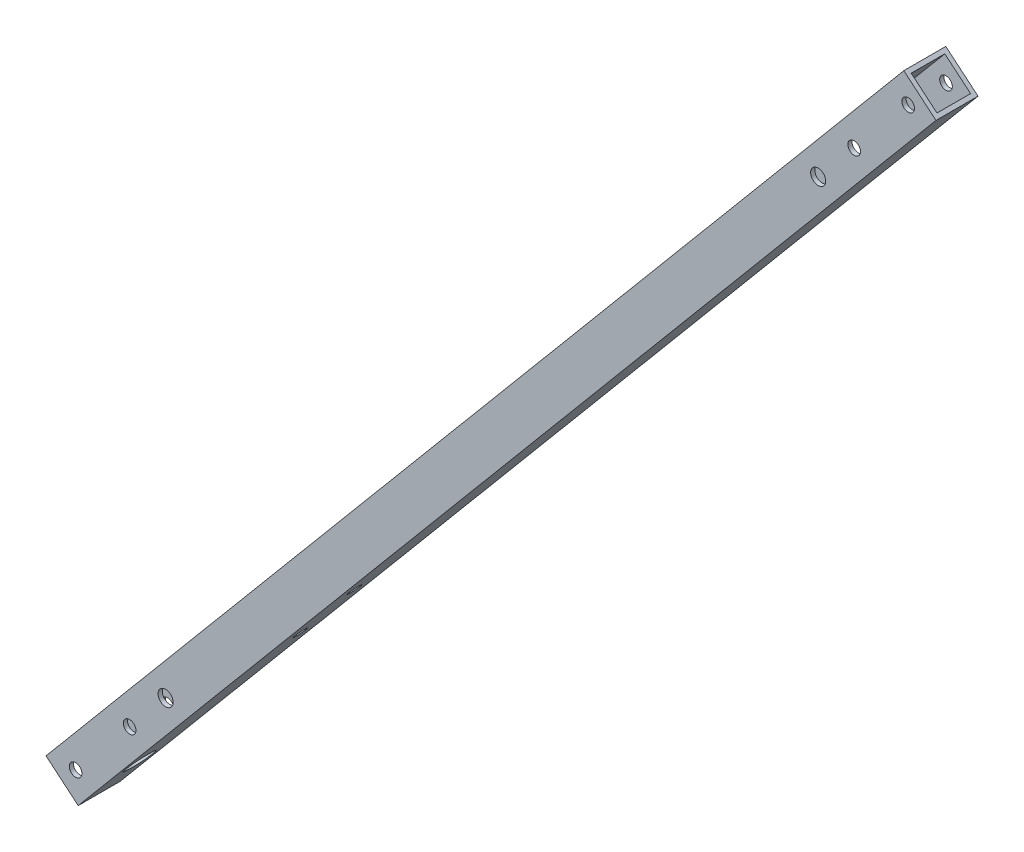
ISO-10303-21;
HEADER;
FILE_DESCRIPTION(('STEP AP214'),'2;1');
FILE_NAME('part.step','',(''),(''),'','','');
FILE_SCHEMA(('AUTOMOTIVE_DESIGN { 1 0 10303 214 1 1 1 1 }'));
ENDSEC;
DATA;
#1=APPLICATION_CONTEXT('core data for automotive mechanical design processes');
#2=APPLICATION_PROTOCOL_DEFINITION('international standard','automotive_design',2000,#1);
#3=PRODUCT_CONTEXT('',#1,'mechanical');
#4=PRODUCT('Part','Part','',(#3));
#5=PRODUCT_RELATED_PRODUCT_CATEGORY('part','',(#4));
#6=PRODUCT_DEFINITION_FORMATION('','',#4);
#7=PRODUCT_DEFINITION_CONTEXT('part definition',#1,'design');
#8=PRODUCT_DEFINITION('design','',#6,#7);
#9=PRODUCT_DEFINITION_SHAPE('','',#8);
#10=(LENGTH_UNIT() NAMED_UNIT(*) SI_UNIT(.MILLI.,.METRE.));
#11=(NAMED_UNIT(*) PLANE_ANGLE_UNIT() SI_UNIT($,.RADIAN.));
#12=(NAMED_UNIT(*) SI_UNIT($,.STERADIAN.) SOLID_ANGLE_UNIT());
#13=UNCERTAINTY_MEASURE_WITH_UNIT(LENGTH_MEASURE(1.E-05),#10,'distance_accuracy_value','');
#14=(GEOMETRIC_REPRESENTATION_CONTEXT(3) GLOBAL_UNCERTAINTY_ASSIGNED_CONTEXT((#13)) GLOBAL_UNIT_ASSIGNED_CONTEXT((#10,
#11,#12)) REPRESENTATION_CONTEXT('',''));
#15=CARTESIAN_POINT('',(0.,0.,0.));
#16=DIRECTION('',(0.,0.,1.));
#17=DIRECTION('',(1.,0.,0.));
#18=AXIS2_PLACEMENT_3D('',#15,#16,#17);
#19=CARTESIAN_POINT('',(0.,0.,-13.5));
#20=DIRECTION('',(0.,0.,1.));
#21=DIRECTION('',(-1.,0.,0.));
#22=AXIS2_PLACEMENT_3D('',#19,#20,#21);
#23=PLANE('',#22);
#24=CARTESIAN_POINT('',(31.2149542335838,48.8684625519902,-13.5));
#25=DIRECTION('',(0.,0.,1.));
#26=DIRECTION('',(1.,0.,0.));
#27=AXIS2_PLACEMENT_3D('',#24,#25,#26);
#28=CIRCLE('',#27,4.99999999999999);
#29=CARTESIAN_POINT('',(36.2149542335838,48.8684625519902,-13.5));
#30=VERTEX_POINT('',#29);
#31=EDGE_CURVE('E420',#30,#30,#28,.T.);
#32=ORIENTED_EDGE('',*,*,#31,.F.);
#33=EDGE_LOOP('',(#32));
#34=FACE_BOUND('',#33,.T.);
#35=CARTESIAN_POINT('',(277.034916912995,341.825286206554,-13.5));
#36=DIRECTION('',(0.,0.,-1.));
#37=DIRECTION('',(-1.,0.,0.));
#38=AXIS2_PLACEMENT_3D('',#35,#36,#37);
#39=CIRCLE('',#38,2.24999999999996);
#40=CARTESIAN_POINT('',(274.784916912995,341.825286206554,-13.5));
#41=VERTEX_POINT('',#40);
#42=EDGE_CURVE('E213',#41,#41,#39,.T.);
#43=ORIENTED_EDGE('',*,*,#42,.T.);
#44=EDGE_LOOP('',(#43));
#45=FACE_BOUND('',#44,.T.);
#46=CARTESIAN_POINT('',(18.3592020398528,33.5475736896108,-13.5));
#47=DIRECTION('',(0.,0.,-1.));
#48=DIRECTION('',(-1.,0.,0.));
#49=AXIS2_PLACEMENT_3D('',#46,#47,#48);
#50=CIRCLE('',#49,2.25);
#51=CARTESIAN_POINT('',(16.1092020398528,33.5475736896108,-13.5));
#52=VERTEX_POINT('',#51);
#53=EDGE_CURVE('E222',#52,#52,#50,.T.);
#54=ORIENTED_EDGE('',*,*,#53,.T.);
#55=EDGE_LOOP('',(#54));
#56=FACE_BOUND('',#55,.T.);
#57=CARTESIAN_POINT('',(-0.924426250743316,10.5662403960414,-13.5));
#58=DIRECTION('',(0.,0.,-1.));
#59=DIRECTION('',(-1.,0.,0.));
#60=AXIS2_PLACEMENT_3D('',#57,#58,#59);
#61=CIRCLE('',#60,2.25);
#62=CARTESIAN_POINT('',(-3.17442625074332,10.5662403960414,-13.5));
#63=VERTEX_POINT('',#62);
#64=EDGE_CURVE('E231',#63,#63,#61,.T.);
#65=ORIENTED_EDGE('',*,*,#64,.T.);
#66=EDGE_LOOP('',(#65));
#67=FACE_BOUND('',#66,.T.);
#68=CARTESIAN_POINT('',(296.318545203591,364.806619500123,-13.5));
#69=DIRECTION('',(0.,0.,-1.));
#70=DIRECTION('',(-1.,0.,0.));
#71=AXIS2_PLACEMENT_3D('',#68,#69,#70);
#72=CIRCLE('',#71,2.24999999999996);
#73=CARTESIAN_POINT('',(294.068545203591,364.806619500123,-13.5));
#74=VERTEX_POINT('',#73);
#75=EDGE_CURVE('E245',#74,#74,#72,.T.);
#76=ORIENTED_EDGE('',*,*,#75,.T.);
#77=EDGE_LOOP('',(#76));
#78=FACE_BOUND('',#77,.T.);
#79=DIRECTION('',(0.766044443118979,-0.642787609686539,0.));
#80=VECTOR('',#79,1.);
#81=CARTESIAN_POINT('',(295.900398007839,373.642634038516,-13.5));
#82=LINE('',#81,#80);
#83=CARTESIAN_POINT('',(295.900398007839,373.642634038516,-13.5));
#84=VERTEX_POINT('',#83);
#85=CARTESIAN_POINT('',(305.092931325267,365.929182722278,-13.5));
#86=VERTEX_POINT('',#85);
#87=EDGE_CURVE('E134',#84,#86,#82,.T.);
#88=ORIENTED_EDGE('',*,*,#87,.F.);
#89=DIRECTION('',(-0.642787609686538,-0.766044443118979,0.));
#90=VECTOR('',#89,1.);
#91=CARTESIAN_POINT('',(-10.3415999821063,8.67763273076831,-13.5));
#92=LINE('',#91,#90);
#93=CARTESIAN_POINT('',(-10.3415999821062,8.67763273076828,-13.5));
#94=VERTEX_POINT('',#93);
#95=EDGE_CURVE('E256',#84,#94,#92,.T.);
#96=ORIENTED_EDGE('',*,*,#95,.T.);
#97=DIRECTION('',(0.76604444311898,-0.642787609686537,0.));
#98=VECTOR('',#97,1.);
#99=CARTESIAN_POINT('',(0.,0.,-13.5));
#100=LINE('',#99,#98);
#101=CARTESIAN_POINT('',(-1.14906666467847,0.964181414529808,-13.5));
#102=VERTEX_POINT('',#101);
#103=EDGE_CURVE('E257',#94,#102,#100,.T.);
#104=ORIENTED_EDGE('',*,*,#103,.T.);
#105=DIRECTION('',(0.642787609686538,0.766044443118979,0.));
#106=VECTOR('',#105,1.);
#107=CARTESIAN_POINT('',(-1.14906666467847,0.964181414529808,-13.5));
#108=LINE('',#107,#106);
#109=EDGE_CURVE('E253',#102,#86,#108,.T.);
#110=ORIENTED_EDGE('',*,*,#109,.T.);
#111=EDGE_LOOP('',(#88,#96,#104,#110));
#112=FACE_BOUND('',#111,.T.);
#113=CARTESIAN_POINT('',(264.179164719264,326.504397344175,-13.5));
#114=DIRECTION('',(0.,0.,1.));
#115=DIRECTION('',(1.,0.,0.));
#116=AXIS2_PLACEMENT_3D('',#113,#114,#115);
#117=CIRCLE('',#116,5.);
#118=CARTESIAN_POINT('',(269.179164719264,326.504397344175,-13.5));
#119=VERTEX_POINT('',#118);
#120=EDGE_CURVE('E411',#119,#119,#117,.T.);
#121=ORIENTED_EDGE('',*,*,#120,.F.);
#122=EDGE_LOOP('',(#121));
#123=FACE_BOUND('',#122,.T.);
#124=ADVANCED_FACE('F43',(#34,#45,#56,#67,#78,#112,#123),#23,.T.);
#125=CARTESIAN_POINT('',(305.735718934954,366.695227165397,-15.));
#126=DIRECTION('',(-0.766044443118979,0.642787609686538,0.));
#127=DIRECTION('',(-0.642787609686538,-0.766044443118979,0.));
#128=AXIS2_PLACEMENT_3D('',#125,#126,#127);
#129=PLANE('',#128);
#130=CARTESIAN_POINT('',(70.7289904301706,86.6251141860083,-7.5));
#131=DIRECTION('',(0.766044443118979,-0.642787609686538,0.));
#132=DIRECTION('',(-0.642787609686538,-0.766044443118979,0.));
#133=AXIS2_PLACEMENT_3D('',#130,#131,#132);
#134=CIRCLE('',#133,2.25);
#135=CARTESIAN_POINT('',(69.2827183083759,84.9015141889906,-7.5));
#136=VERTEX_POINT('',#135);
#137=EDGE_CURVE('E174',#136,#136,#134,.T.);
#138=ORIENTED_EDGE('',*,*,#137,.T.);
#139=EDGE_LOOP('',(#138));
#140=FACE_BOUND('',#139,.T.);
#141=CARTESIAN_POINT('',(90.0126187207668,109.606447479578,-7.5));
#142=DIRECTION('',(0.766044443118979,-0.642787609686538,0.));
#143=DIRECTION('',(-0.642787609686538,-0.766044443118979,0.));
#144=AXIS2_PLACEMENT_3D('',#141,#142,#143);
#145=CIRCLE('',#144,2.25);
#146=CARTESIAN_POINT('',(88.566346598972,107.88284748256,-7.5));
#147=VERTEX_POINT('',#146);
#148=EDGE_CURVE('E183',#147,#147,#145,.T.);
#149=ORIENTED_EDGE('',*,*,#148,.T.);
#150=EDGE_LOOP('',(#149));
#151=FACE_BOUND('',#150,.T.);
#152=DIRECTION('',(0.,0.,1.));
#153=VECTOR('',#152,1.);
#154=CARTESIAN_POINT('',(305.092931325267,365.929182722278,-13.5));
#155=LINE('',#154,#153);
#156=CARTESIAN_POINT('',(305.092931325267,365.929182722278,-1.5));
#157=VERTEX_POINT('',#156);
#158=EDGE_CURVE('E120',#86,#157,#155,.T.);
#159=ORIENTED_EDGE('',*,*,#158,.F.);
#160=ORIENTED_EDGE('',*,*,#109,.F.);
#161=DIRECTION('',(0.,0.,1.));
#162=VECTOR('',#161,1.);
#163=CARTESIAN_POINT('',(-1.14906666467846,0.964181414529863,-15.));
#164=LINE('',#163,#162);
#165=CARTESIAN_POINT('',(-1.14906666467847,0.964181414529808,-1.5));
#166=VERTEX_POINT('',#165);
#167=EDGE_CURVE('E127',#102,#166,#164,.T.);
#168=ORIENTED_EDGE('',*,*,#167,.T.);
#169=DIRECTION('',(0.642787609686538,0.766044443118979,0.));
#170=VECTOR('',#169,1.);
#171=CARTESIAN_POINT('',(-1.14906666467847,0.964181414529808,-1.5));
#172=LINE('',#171,#170);
#173=EDGE_CURVE('E114',#166,#157,#172,.T.);
#174=ORIENTED_EDGE('',*,*,#173,.T.);
#175=EDGE_LOOP('',(#159,#160,#168,#174));
#176=FACE_BOUND('',#175,.T.);
#177=CARTESIAN_POINT('',(13.3136545532686,18.2001813847068,-7.5));
#178=DIRECTION('',(-0.766044443118979,0.642787609686538,0.));
#179=DIRECTION('',(0.642787609686538,0.766044443118979,0.));
#180=AXIS2_PLACEMENT_3D('',#177,#178,#179);
#181=CIRCLE('',#180,4.99999999999999);
#182=CARTESIAN_POINT('',(16.5275926017013,22.0304036003017,-7.5));
#183=VERTEX_POINT('',#182);
#184=EDGE_CURVE('E136',#183,#183,#181,.T.);
#185=ORIENTED_EDGE('',*,*,#184,.F.);
#186=EDGE_LOOP('',(#185));
#187=FACE_BOUND('',#186,.T.);
#188=ADVANCED_FACE('F123',(#140,#151,#176,#187),#129,.T.);
#189=CARTESIAN_POINT('',(-11.4906666467847,9.64181414529806,-15.));
#190=DIRECTION('',(0.642787609686537,0.76604444311898,0.));
#191=DIRECTION('',(-0.76604444311898,0.642787609686537,0.));
#192=AXIS2_PLACEMENT_3D('',#189,#190,#191);
#193=PLANE('',#192);
#194=DIRECTION('',(0.76604444311898,-0.642787609686537,0.));
#195=VECTOR('',#194,1.);
#196=CARTESIAN_POINT('',(-11.4906666467847,9.64181414529806,0.));
#197=LINE('',#196,#195);
#198=CARTESIAN_POINT('',(-11.4906666467847,9.64181414529806,0.));
#199=VERTEX_POINT('',#198);
#200=CARTESIAN_POINT('',(0.,0.,0.));
#201=VERTEX_POINT('',#200);
#202=EDGE_CURVE('E266',#199,#201,#197,.T.);
#203=ORIENTED_EDGE('',*,*,#202,.F.);
#204=DIRECTION('',(0.,0.,1.));
#205=VECTOR('',#204,1.);
#206=CARTESIAN_POINT('',(-11.4906666467847,9.64181414529806,-15.));
#207=LINE('',#206,#205);
#208=CARTESIAN_POINT('',(-11.4906666467847,9.64181414529806,-15.));
#209=VERTEX_POINT('',#208);
#210=EDGE_CURVE('E53',#209,#199,#207,.T.);
#211=ORIENTED_EDGE('',*,*,#210,.F.);
#212=DIRECTION('',(0.76604444311898,-0.642787609686537,0.));
#213=VECTOR('',#212,1.);
#214=CARTESIAN_POINT('',(-11.4906666467847,9.64181414529806,-15.));
#215=LINE('',#214,#213);
#216=CARTESIAN_POINT('',(0.,0.,-15.));
#217=VERTEX_POINT('',#216);
#218=EDGE_CURVE('E275',#209,#217,#215,.T.);
#219=ORIENTED_EDGE('',*,*,#218,.T.);
#220=DIRECTION('',(0.,0.,1.));
#221=VECTOR('',#220,1.);
#222=CARTESIAN_POINT('',(0.,0.,-15.));
#223=LINE('',#222,#221);
#224=EDGE_CURVE('E11',#217,#201,#223,.T.);
#225=ORIENTED_EDGE('',*,*,#224,.T.);
#226=EDGE_LOOP('',(#203,#211,#219,#225));
#227=FACE_BOUND('',#226,.T.);
#228=DIRECTION('',(0.76604444311898,-0.642787609686537,0.));
#229=VECTOR('',#228,1.);
#230=CARTESIAN_POINT('',(0.,0.,-1.5));
#231=LINE('',#230,#229);
#232=CARTESIAN_POINT('',(-10.3415999821062,8.67763273076828,-1.5));
#233=VERTEX_POINT('',#232);
#234=EDGE_CURVE('E129',#233,#166,#231,.T.);
#235=ORIENTED_EDGE('',*,*,#234,.T.);
#236=ORIENTED_EDGE('',*,*,#167,.F.);
#237=ORIENTED_EDGE('',*,*,#103,.F.);
#238=DIRECTION('',(0.,0.,1.));
#239=VECTOR('',#238,1.);
#240=CARTESIAN_POINT('',(-10.3415999821062,8.67763273076828,-15.));
#241=LINE('',#240,#239);
#242=EDGE_CURVE('E261',#94,#233,#241,.T.);
#243=ORIENTED_EDGE('',*,*,#242,.T.);
#244=EDGE_LOOP('',(#235,#236,#237,#243));
#245=FACE_BOUND('',#244,.T.);
#246=ADVANCED_FACE('F45',(#227,#245),#193,.F.);
#247=CARTESIAN_POINT('',(306.884785599632,365.731045750867,-15.));
#248=DIRECTION('',(-0.766044443118979,0.642787609686538,0.));
#249=DIRECTION('',(-0.642787609686538,-0.766044443118979,0.));
#250=AXIS2_PLACEMENT_3D('',#247,#248,#249);
#251=PLANE('',#250);
#252=CARTESIAN_POINT('',(14.4627212179471,17.235999970177,-7.5));
#253=DIRECTION('',(-0.766044443118979,0.642787609686538,0.));
#254=DIRECTION('',(0.642787609686538,0.766044443118979,0.));
#255=AXIS2_PLACEMENT_3D('',#252,#253,#254);
#256=CIRCLE('',#255,4.99999999999999);
#257=CARTESIAN_POINT('',(17.6766592663798,21.0662221857719,-7.5));
#258=VERTEX_POINT('',#257);
#259=EDGE_CURVE('E141',#258,#258,#256,.T.);
#260=ORIENTED_EDGE('',*,*,#259,.T.);
#261=EDGE_LOOP('',(#260));
#262=FACE_BOUND('',#261,.T.);
#263=CARTESIAN_POINT('',(91.1616853854452,108.642266065048,-7.5));
#264=DIRECTION('',(0.766044443118979,-0.642787609686538,0.));
#265=DIRECTION('',(-0.642787609686538,-0.766044443118979,0.));
#266=AXIS2_PLACEMENT_3D('',#263,#264,#265);
#267=CIRCLE('',#266,2.25);
#268=CARTESIAN_POINT('',(89.7154132636505,106.91866606803,-7.5));
#269=VERTEX_POINT('',#268);
#270=EDGE_CURVE('E187',#269,#269,#267,.T.);
#271=ORIENTED_EDGE('',*,*,#270,.F.);
#272=EDGE_LOOP('',(#271));
#273=FACE_BOUND('',#272,.T.);
#274=CARTESIAN_POINT('',(71.8780570948491,85.6609327714785,-7.5));
#275=DIRECTION('',(0.766044443118979,-0.642787609686538,0.));
#276=DIRECTION('',(-0.642787609686538,-0.766044443118979,0.));
#277=AXIS2_PLACEMENT_3D('',#274,#275,#276);
#278=CIRCLE('',#277,2.25);
#279=CARTESIAN_POINT('',(70.4317849730544,83.9373327744608,-7.5));
#280=VERTEX_POINT('',#279);
#281=EDGE_CURVE('E178',#280,#280,#278,.T.);
#282=ORIENTED_EDGE('',*,*,#281,.F.);
#283=EDGE_LOOP('',(#282));
#284=FACE_BOUND('',#283,.T.);
#285=DIRECTION('',(0.642787609686538,0.766044443118979,0.));
#286=VECTOR('',#285,1.);
#287=CARTESIAN_POINT('',(306.884785599632,365.731045750867,0.));
#288=LINE('',#287,#286);
#289=CARTESIAN_POINT('',(306.241997989946,364.965001307748,0.));
#290=VERTEX_POINT('',#289);
#291=EDGE_CURVE('E290',#201,#290,#288,.T.);
#292=ORIENTED_EDGE('',*,*,#291,.F.);
#293=ORIENTED_EDGE('',*,*,#224,.F.);
#294=DIRECTION('',(0.642787609686538,0.766044443118979,0.));
#295=VECTOR('',#294,1.);
#296=CARTESIAN_POINT('',(306.884785599632,365.731045750867,-15.));
#297=LINE('',#296,#295);
#298=CARTESIAN_POINT('',(306.241997989946,364.965001307748,-15.));
#299=VERTEX_POINT('',#298);
#300=EDGE_CURVE('E279',#217,#299,#297,.T.);
#301=ORIENTED_EDGE('',*,*,#300,.T.);
#302=DIRECTION('',(0.,0.,1.));
#303=VECTOR('',#302,1.);
#304=CARTESIAN_POINT('',(306.241997989946,364.965001307748,-15.));
#305=LINE('',#304,#303);
#306=EDGE_CURVE('E149',#299,#290,#305,.T.);
#307=ORIENTED_EDGE('',*,*,#306,.T.);
#308=EDGE_LOOP('',(#292,#293,#301,#307));
#309=FACE_BOUND('',#308,.T.);
#310=ADVANCED_FACE('F340',(#262,#273,#284,#309),#251,.F.);
#311=CARTESIAN_POINT('',(295.394118952847,375.372859896165,-15.));
#312=DIRECTION('',(0.766044443118979,-0.642787609686538,0.));
#313=DIRECTION('',(0.642787609686538,0.766044443118979,0.));
#314=AXIS2_PLACEMENT_3D('',#311,#312,#313);
#315=PLANE('',#314);
#316=CARTESIAN_POINT('',(79.6710187386605,118.284080210346,-7.5));
#317=DIRECTION('',(0.76604444311898,-0.642787609686538,0.));
#318=DIRECTION('',(-0.642787609686538,-0.766044443118979,0.));
#319=AXIS2_PLACEMENT_3D('',#316,#317,#318);
#320=CIRCLE('',#319,2.25);
#321=CARTESIAN_POINT('',(78.2247466168658,116.560480213328,-7.5));
#322=VERTEX_POINT('',#321);
#323=EDGE_CURVE('E162',#322,#322,#320,.T.);
#324=ORIENTED_EDGE('',*,*,#323,.T.);
#325=EDGE_LOOP('',(#324));
#326=FACE_BOUND('',#325,.T.);
#327=CARTESIAN_POINT('',(60.3873904480644,95.3027469167766,-7.5));
#328=DIRECTION('',(0.76604444311898,-0.642787609686538,0.));
#329=DIRECTION('',(-0.642787609686538,-0.766044443118979,0.));
#330=AXIS2_PLACEMENT_3D('',#327,#328,#329);
#331=CIRCLE('',#330,2.25);
#332=CARTESIAN_POINT('',(58.9411183262697,93.5791469197589,-7.5));
#333=VERTEX_POINT('',#332);
#334=EDGE_CURVE('E167',#333,#333,#331,.T.);
#335=ORIENTED_EDGE('',*,*,#334,.T.);
#336=EDGE_LOOP('',(#335));
#337=FACE_BOUND('',#336,.T.);
#338=CARTESIAN_POINT('',(2.9720545711624,26.8778141154751,-7.5));
#339=DIRECTION('',(0.76604444311898,-0.642787609686538,0.));
#340=DIRECTION('',(-0.642787609686538,-0.766044443118979,0.));
#341=AXIS2_PLACEMENT_3D('',#338,#339,#340);
#342=CIRCLE('',#341,2.7);
#343=CARTESIAN_POINT('',(1.23652802500874,24.8094941190539,-7.5));
#344=VERTEX_POINT('',#343);
#345=EDGE_CURVE('E161',#344,#344,#342,.T.);
#346=ORIENTED_EDGE('',*,*,#345,.T.);
#347=EDGE_LOOP('',(#346));
#348=FACE_BOUND('',#347,.T.);
#349=DIRECTION('',(-0.642787609686538,-0.766044443118979,0.));
#350=VECTOR('',#349,1.);
#351=CARTESIAN_POINT('',(295.394118952847,375.372859896165,-15.));
#352=LINE('',#351,#350);
#353=CARTESIAN_POINT('',(294.751331343161,374.606815453046,-15.));
#354=VERTEX_POINT('',#353);
#355=EDGE_CURVE('E284',#354,#209,#352,.T.);
#356=ORIENTED_EDGE('',*,*,#355,.T.);
#357=ORIENTED_EDGE('',*,*,#210,.T.);
#358=DIRECTION('',(-0.642787609686538,-0.766044443118979,0.));
#359=VECTOR('',#358,1.);
#360=CARTESIAN_POINT('',(295.394118952847,375.372859896165,0.));
#361=LINE('',#360,#359);
#362=CARTESIAN_POINT('',(294.751331343161,374.606815453046,0.));
#363=VERTEX_POINT('',#362);
#364=EDGE_CURVE('E280',#363,#199,#361,.T.);
#365=ORIENTED_EDGE('',*,*,#364,.F.);
#366=DIRECTION('',(0.,0.,-1.));
#367=VECTOR('',#366,1.);
#368=CARTESIAN_POINT('',(294.751331343161,374.606815453046,-15.));
#369=LINE('',#368,#367);
#370=EDGE_CURVE('E154',#363,#354,#369,.T.);
#371=ORIENTED_EDGE('',*,*,#370,.T.);
#372=EDGE_LOOP('',(#356,#357,#365,#371));
#373=FACE_BOUND('',#372,.T.);
#374=ADVANCED_FACE('F336',(#326,#337,#348,#373),#315,.F.);
#375=CARTESIAN_POINT('',(0.,0.,-15.));
#376=DIRECTION('',(0.,0.,1.));
#377=DIRECTION('',(-1.,0.,0.));
#378=AXIS2_PLACEMENT_3D('',#375,#376,#377);
#379=PLANE('',#378);
#380=CARTESIAN_POINT('',(31.2149542335838,48.8684625519902,-15.));
#381=DIRECTION('',(0.,0.,1.));
#382=DIRECTION('',(1.,0.,0.));
#383=AXIS2_PLACEMENT_3D('',#380,#381,#382);
#384=CIRCLE('',#383,4.99999999999999);
#385=CARTESIAN_POINT('',(36.2149542335838,48.8684625519902,-15.));
#386=VERTEX_POINT('',#385);
#387=EDGE_CURVE('E425',#386,#386,#384,.T.);
#388=ORIENTED_EDGE('',*,*,#387,.T.);
#389=EDGE_LOOP('',(#388));
#390=FACE_BOUND('',#389,.T.);
#391=CARTESIAN_POINT('',(264.179164719264,326.504397344175,-15.));
#392=DIRECTION('',(0.,0.,1.));
#393=DIRECTION('',(1.,0.,0.));
#394=AXIS2_PLACEMENT_3D('',#391,#392,#393);
#395=CIRCLE('',#394,5.);
#396=CARTESIAN_POINT('',(269.179164719264,326.504397344175,-15.));
#397=VERTEX_POINT('',#396);
#398=EDGE_CURVE('E415',#397,#397,#395,.T.);
#399=ORIENTED_EDGE('',*,*,#398,.T.);
#400=EDGE_LOOP('',(#399));
#401=FACE_BOUND('',#400,.T.);
#402=CARTESIAN_POINT('',(296.318545203591,364.806619500123,-15.));
#403=DIRECTION('',(0.,0.,1.));
#404=DIRECTION('',(1.,0.,0.));
#405=AXIS2_PLACEMENT_3D('',#402,#403,#404);
#406=CIRCLE('',#405,2.24999999999996);
#407=CARTESIAN_POINT('',(298.568545203591,364.806619500123,-15.));
#408=VERTEX_POINT('',#407);
#409=EDGE_CURVE('E191',#408,#408,#406,.T.);
#410=ORIENTED_EDGE('',*,*,#409,.T.);
#411=EDGE_LOOP('',(#410));
#412=FACE_BOUND('',#411,.T.);
#413=CARTESIAN_POINT('',(-0.924426250743316,10.5662403960414,-15.));
#414=DIRECTION('',(0.,0.,1.));
#415=DIRECTION('',(1.,0.,0.));
#416=AXIS2_PLACEMENT_3D('',#413,#414,#415);
#417=CIRCLE('',#416,2.25);
#418=CARTESIAN_POINT('',(1.32557374925668,10.5662403960414,-15.));
#419=VERTEX_POINT('',#418);
#420=EDGE_CURVE('E196',#419,#419,#417,.T.);
#421=ORIENTED_EDGE('',*,*,#420,.T.);
#422=EDGE_LOOP('',(#421));
#423=FACE_BOUND('',#422,.T.);
#424=CARTESIAN_POINT('',(18.3592020398528,33.5475736896108,-15.));
#425=DIRECTION('',(0.,0.,1.));
#426=DIRECTION('',(1.,0.,0.));
#427=AXIS2_PLACEMENT_3D('',#424,#425,#426);
#428=CIRCLE('',#427,2.25);
#429=CARTESIAN_POINT('',(20.6092020398528,33.5475736896108,-15.));
#430=VERTEX_POINT('',#429);
#431=EDGE_CURVE('E192',#430,#430,#428,.T.);
#432=ORIENTED_EDGE('',*,*,#431,.T.);
#433=EDGE_LOOP('',(#432));
#434=FACE_BOUND('',#433,.T.);
#435=CARTESIAN_POINT('',(277.034916912995,341.825286206554,-15.));
#436=DIRECTION('',(0.,0.,1.));
#437=DIRECTION('',(1.,0.,0.));
#438=AXIS2_PLACEMENT_3D('',#435,#436,#437);
#439=CIRCLE('',#438,2.24999999999996);
#440=CARTESIAN_POINT('',(279.284916912994,341.825286206554,-15.));
#441=VERTEX_POINT('',#440);
#442=EDGE_CURVE('E197',#441,#441,#439,.T.);
#443=ORIENTED_EDGE('',*,*,#442,.T.);
#444=EDGE_LOOP('',(#443));
#445=FACE_BOUND('',#444,.T.);
#446=ORIENTED_EDGE('',*,*,#300,.F.);
#447=ORIENTED_EDGE('',*,*,#218,.F.);
#448=ORIENTED_EDGE('',*,*,#355,.F.);
#449=DIRECTION('',(0.76604444311898,-0.642787609686537,0.));
#450=VECTOR('',#449,1.);
#451=CARTESIAN_POINT('',(294.751331343161,374.606815453046,-15.));
#452=LINE('',#451,#450);
#453=EDGE_CURVE('E158',#354,#299,#452,.T.);
#454=ORIENTED_EDGE('',*,*,#453,.T.);
#455=EDGE_LOOP('',(#446,#447,#448,#454));
#456=FACE_BOUND('',#455,.T.);
#457=ADVANCED_FACE('F339',(#390,#401,#412,#423,#434,#445,#456),#379,.F.);
#458=CARTESIAN_POINT('',(0.,0.,0.));
#459=DIRECTION('',(0.,0.,1.));
#460=DIRECTION('',(-1.,0.,0.));
#461=AXIS2_PLACEMENT_3D('',#458,#459,#460);
#462=PLANE('',#461);
#463=DIRECTION('',(-0.76604444311898,0.642787609686537,0.));
#464=VECTOR('',#463,1.);
#465=CARTESIAN_POINT('',(294.751331343161,374.606815453046,0.));
#466=LINE('',#465,#464);
#467=EDGE_CURVE('E61',#290,#363,#466,.T.);
#468=ORIENTED_EDGE('',*,*,#467,.T.);
#469=ORIENTED_EDGE('',*,*,#364,.T.);
#470=ORIENTED_EDGE('',*,*,#202,.T.);
#471=ORIENTED_EDGE('',*,*,#291,.T.);
#472=EDGE_LOOP('',(#468,#469,#470,#471));
#473=FACE_BOUND('',#472,.T.);
#474=CARTESIAN_POINT('',(296.318545203591,364.806619500123,0.));
#475=DIRECTION('',(0.,0.,-1.));
#476=DIRECTION('',(-1.,0.,0.));
#477=AXIS2_PLACEMENT_3D('',#474,#475,#476);
#478=CIRCLE('',#477,2.24999999999996);
#479=CARTESIAN_POINT('',(294.068545203591,364.806619500123,0.));
#480=VERTEX_POINT('',#479);
#481=EDGE_CURVE('E249',#480,#480,#478,.T.);
#482=ORIENTED_EDGE('',*,*,#481,.T.);
#483=EDGE_LOOP('',(#482));
#484=FACE_BOUND('',#483,.T.);
#485=CARTESIAN_POINT('',(264.179164719264,326.504397344175,0.));
#486=DIRECTION('',(0.,0.,-1.));
#487=DIRECTION('',(-1.,0.,0.));
#488=AXIS2_PLACEMENT_3D('',#485,#486,#487);
#489=CIRCLE('',#488,2.6999999999999);
#490=CARTESIAN_POINT('',(261.479164719264,326.504397344175,0.));
#491=VERTEX_POINT('',#490);
#492=EDGE_CURVE('E240',#491,#491,#489,.T.);
#493=ORIENTED_EDGE('',*,*,#492,.T.);
#494=EDGE_LOOP('',(#493));
#495=FACE_BOUND('',#494,.T.);
#496=CARTESIAN_POINT('',(-0.924426250743316,10.5662403960414,0.));
#497=DIRECTION('',(0.,0.,-1.));
#498=DIRECTION('',(-1.,0.,0.));
#499=AXIS2_PLACEMENT_3D('',#496,#497,#498);
#500=CIRCLE('',#499,2.25);
#501=CARTESIAN_POINT('',(-3.17442625074332,10.5662403960414,0.));
#502=VERTEX_POINT('',#501);
#503=EDGE_CURVE('E235',#502,#502,#500,.T.);
#504=ORIENTED_EDGE('',*,*,#503,.T.);
#505=EDGE_LOOP('',(#504));
#506=FACE_BOUND('',#505,.T.);
#507=CARTESIAN_POINT('',(18.3592020398528,33.5475736896108,0.));
#508=DIRECTION('',(0.,0.,-1.));
#509=DIRECTION('',(-1.,0.,0.));
#510=AXIS2_PLACEMENT_3D('',#507,#508,#509);
#511=CIRCLE('',#510,2.25);
#512=CARTESIAN_POINT('',(16.1092020398528,33.5475736896108,0.));
#513=VERTEX_POINT('',#512);
#514=EDGE_CURVE('E226',#513,#513,#511,.T.);
#515=ORIENTED_EDGE('',*,*,#514,.T.);
#516=EDGE_LOOP('',(#515));
#517=FACE_BOUND('',#516,.T.);
#518=CARTESIAN_POINT('',(277.034916912995,341.825286206554,0.));
#519=DIRECTION('',(0.,0.,-1.));
#520=DIRECTION('',(-1.,0.,0.));
#521=AXIS2_PLACEMENT_3D('',#518,#519,#520);
#522=CIRCLE('',#521,2.24999999999996);
#523=CARTESIAN_POINT('',(274.784916912995,341.825286206554,0.));
#524=VERTEX_POINT('',#523);
#525=EDGE_CURVE('E217',#524,#524,#522,.T.);
#526=ORIENTED_EDGE('',*,*,#525,.T.);
#527=EDGE_LOOP('',(#526));
#528=FACE_BOUND('',#527,.T.);
#529=CARTESIAN_POINT('',(31.2149542335838,48.8684625519902,0.));
#530=DIRECTION('',(0.,0.,-1.));
#531=DIRECTION('',(-1.,0.,0.));
#532=AXIS2_PLACEMENT_3D('',#529,#530,#531);
#533=CIRCLE('',#532,2.7);
#534=CARTESIAN_POINT('',(28.5149542335838,48.8684625519902,0.));
#535=VERTEX_POINT('',#534);
#536=EDGE_CURVE('E208',#535,#535,#533,.T.);
#537=ORIENTED_EDGE('',*,*,#536,.T.);
#538=EDGE_LOOP('',(#537));
#539=FACE_BOUND('',#538,.T.);
#540=ADVANCED_FACE('F355',(#473,#484,#495,#506,#517,#528,#539),#462,.T.);
#541=CARTESIAN_POINT('',(296.543185617526,374.408678481635,-15.));
#542=DIRECTION('',(0.766044443118979,-0.642787609686538,0.));
#543=DIRECTION('',(0.642787609686538,0.766044443118979,0.));
#544=AXIS2_PLACEMENT_3D('',#541,#542,#543);
#545=PLANE('',#544);
#546=DIRECTION('',(0.,0.,-1.));
#547=VECTOR('',#546,1.);
#548=CARTESIAN_POINT('',(295.900398007839,373.642634038516,-13.5));
#549=LINE('',#548,#547);
#550=CARTESIAN_POINT('',(295.900398007839,373.642634038516,-1.5));
#551=VERTEX_POINT('',#550);
#552=EDGE_CURVE('E119',#551,#84,#549,.T.);
#553=ORIENTED_EDGE('',*,*,#552,.F.);
#554=DIRECTION('',(-0.642787609686538,-0.766044443118979,0.));
#555=VECTOR('',#554,1.);
#556=CARTESIAN_POINT('',(-10.3415999821063,8.67763273076831,-1.5));
#557=LINE('',#556,#555);
#558=EDGE_CURVE('E116',#551,#233,#557,.T.);
#559=ORIENTED_EDGE('',*,*,#558,.T.);
#560=ORIENTED_EDGE('',*,*,#242,.F.);
#561=ORIENTED_EDGE('',*,*,#95,.F.);
#562=EDGE_LOOP('',(#553,#559,#560,#561));
#563=FACE_BOUND('',#562,.T.);
#564=CARTESIAN_POINT('',(80.820085403339,117.319898795816,-7.5));
#565=DIRECTION('',(-0.766044443118979,0.642787609686538,0.));
#566=DIRECTION('',(0.642787609686538,0.766044443118979,0.));
#567=AXIS2_PLACEMENT_3D('',#564,#565,#566);
#568=CIRCLE('',#567,2.25);
#569=CARTESIAN_POINT('',(82.2663575251337,119.043498792834,-7.5));
#570=VERTEX_POINT('',#569);
#571=EDGE_CURVE('E47',#570,#570,#568,.T.);
#572=ORIENTED_EDGE('',*,*,#571,.T.);
#573=EDGE_LOOP('',(#572));
#574=FACE_BOUND('',#573,.T.);
#575=CARTESIAN_POINT('',(61.5364571127428,94.3385655022468,-7.5));
#576=DIRECTION('',(-0.766044443118979,0.642787609686538,0.));
#577=DIRECTION('',(0.642787609686538,0.766044443118979,0.));
#578=AXIS2_PLACEMENT_3D('',#575,#576,#577);
#579=CIRCLE('',#578,2.25);
#580=CARTESIAN_POINT('',(62.9827292345375,96.0621654992646,-7.5));
#581=VERTEX_POINT('',#580);
#582=EDGE_CURVE('E179',#581,#581,#579,.T.);
#583=ORIENTED_EDGE('',*,*,#582,.T.);
#584=EDGE_LOOP('',(#583));
#585=FACE_BOUND('',#584,.T.);
#586=CARTESIAN_POINT('',(4.12112123584085,25.9136327009453,-7.5));
#587=DIRECTION('',(-0.766044443118979,0.642787609686538,0.));
#588=DIRECTION('',(0.642787609686538,0.766044443118979,0.));
#589=AXIS2_PLACEMENT_3D('',#586,#587,#588);
#590=CIRCLE('',#589,2.7);
#591=CARTESIAN_POINT('',(5.85664778199451,27.9819526973666,-7.5));
#592=VERTEX_POINT('',#591);
#593=EDGE_CURVE('E166',#592,#592,#590,.T.);
#594=ORIENTED_EDGE('',*,*,#593,.T.);
#595=EDGE_LOOP('',(#594));
#596=FACE_BOUND('',#595,.T.);
#597=ADVANCED_FACE('F324',(#563,#574,#585,#596),#545,.T.);
#598=CARTESIAN_POINT('',(0.,0.,-1.5));
#599=DIRECTION('',(0.,0.,1.));
#600=DIRECTION('',(-1.,0.,0.));
#601=AXIS2_PLACEMENT_3D('',#598,#599,#600);
#602=PLANE('',#601);
#603=CARTESIAN_POINT('',(296.318545203591,364.806619500123,-1.5));
#604=DIRECTION('',(0.,0.,-1.));
#605=DIRECTION('',(-1.,0.,0.));
#606=AXIS2_PLACEMENT_3D('',#603,#604,#605);
#607=CIRCLE('',#606,2.24999999999996);
#608=CARTESIAN_POINT('',(294.068545203591,364.806619500123,-1.5));
#609=VERTEX_POINT('',#608);
#610=EDGE_CURVE('E244',#609,#609,#607,.T.);
#611=ORIENTED_EDGE('',*,*,#610,.F.);
#612=EDGE_LOOP('',(#611));
#613=FACE_BOUND('',#612,.T.);
#614=CARTESIAN_POINT('',(264.179164719264,326.504397344175,-1.5));
#615=DIRECTION('',(0.,0.,-1.));
#616=DIRECTION('',(-1.,0.,0.));
#617=AXIS2_PLACEMENT_3D('',#614,#615,#616);
#618=CIRCLE('',#617,2.6999999999999);
#619=CARTESIAN_POINT('',(261.479164719264,326.504397344175,-1.5));
#620=VERTEX_POINT('',#619);
#621=EDGE_CURVE('E239',#620,#620,#618,.T.);
#622=ORIENTED_EDGE('',*,*,#621,.F.);
#623=EDGE_LOOP('',(#622));
#624=FACE_BOUND('',#623,.T.);
#625=CARTESIAN_POINT('',(-0.924426250743316,10.5662403960414,-1.5));
#626=DIRECTION('',(0.,0.,-1.));
#627=DIRECTION('',(-1.,0.,0.));
#628=AXIS2_PLACEMENT_3D('',#625,#626,#627);
#629=CIRCLE('',#628,2.25);
#630=CARTESIAN_POINT('',(-3.17442625074332,10.5662403960414,-1.5));
#631=VERTEX_POINT('',#630);
#632=EDGE_CURVE('E230',#631,#631,#629,.T.);
#633=ORIENTED_EDGE('',*,*,#632,.F.);
#634=EDGE_LOOP('',(#633));
#635=FACE_BOUND('',#634,.T.);
#636=CARTESIAN_POINT('',(18.3592020398528,33.5475736896108,-1.5));
#637=DIRECTION('',(0.,0.,-1.));
#638=DIRECTION('',(-1.,0.,0.));
#639=AXIS2_PLACEMENT_3D('',#636,#637,#638);
#640=CIRCLE('',#639,2.25);
#641=CARTESIAN_POINT('',(16.1092020398528,33.5475736896108,-1.5));
#642=VERTEX_POINT('',#641);
#643=EDGE_CURVE('E221',#642,#642,#640,.T.);
#644=ORIENTED_EDGE('',*,*,#643,.F.);
#645=EDGE_LOOP('',(#644));
#646=FACE_BOUND('',#645,.T.);
#647=CARTESIAN_POINT('',(277.034916912995,341.825286206554,-1.5));
#648=DIRECTION('',(0.,0.,-1.));
#649=DIRECTION('',(-1.,0.,0.));
#650=AXIS2_PLACEMENT_3D('',#647,#648,#649);
#651=CIRCLE('',#650,2.24999999999996);
#652=CARTESIAN_POINT('',(274.784916912995,341.825286206554,-1.5));
#653=VERTEX_POINT('',#652);
#654=EDGE_CURVE('E212',#653,#653,#651,.T.);
#655=ORIENTED_EDGE('',*,*,#654,.F.);
#656=EDGE_LOOP('',(#655));
#657=FACE_BOUND('',#656,.T.);
#658=CARTESIAN_POINT('',(31.2149542335838,48.8684625519902,-1.5));
#659=DIRECTION('',(0.,0.,-1.));
#660=DIRECTION('',(-1.,0.,0.));
#661=AXIS2_PLACEMENT_3D('',#658,#659,#660);
#662=CIRCLE('',#661,2.7);
#663=CARTESIAN_POINT('',(28.5149542335838,48.8684625519902,-1.5));
#664=VERTEX_POINT('',#663);
#665=EDGE_CURVE('E204',#664,#664,#662,.T.);
#666=ORIENTED_EDGE('',*,*,#665,.F.);
#667=EDGE_LOOP('',(#666));
#668=FACE_BOUND('',#667,.T.);
#669=ORIENTED_EDGE('',*,*,#173,.F.);
#670=ORIENTED_EDGE('',*,*,#234,.F.);
#671=ORIENTED_EDGE('',*,*,#558,.F.);
#672=DIRECTION('',(-0.766044443118979,0.642787609686539,0.));
#673=VECTOR('',#672,1.);
#674=CARTESIAN_POINT('',(295.900398007839,373.642634038516,-1.5));
#675=LINE('',#674,#673);
#676=EDGE_CURVE('E69',#157,#551,#675,.T.);
#677=ORIENTED_EDGE('',*,*,#676,.F.);
#678=EDGE_LOOP('',(#669,#670,#671,#677));
#679=FACE_BOUND('',#678,.T.);
#680=ADVANCED_FACE('F112',(#613,#624,#635,#646,#657,#668,#679),#602,.F.);
#681=CARTESIAN_POINT('',(31.2149542335838,48.8684625519902,10.));
#682=DIRECTION('',(0.,0.,-1.));
#683=DIRECTION('',(1.,0.,0.));
#684=AXIS2_PLACEMENT_3D('',#681,#682,#683);
#685=CYLINDRICAL_SURFACE('',#684,2.7);
#686=ORIENTED_EDGE('',*,*,#536,.F.);
#687=EDGE_LOOP('',(#686));
#688=FACE_BOUND('',#687,.T.);
#689=ORIENTED_EDGE('',*,*,#665,.T.);
#690=EDGE_LOOP('',(#689));
#691=FACE_BOUND('',#690,.T.);
#692=ADVANCED_FACE('F379',(#688,#691),#685,.F.);
#693=CARTESIAN_POINT('',(277.034916912995,341.825286206554,10.));
#694=DIRECTION('',(0.,0.,-1.));
#695=DIRECTION('',(1.,0.,0.));
#696=AXIS2_PLACEMENT_3D('',#693,#694,#695);
#697=CYLINDRICAL_SURFACE('',#696,2.24999999999996);
#698=ORIENTED_EDGE('',*,*,#525,.F.);
#699=EDGE_LOOP('',(#698));
#700=FACE_BOUND('',#699,.T.);
#701=ORIENTED_EDGE('',*,*,#654,.T.);
#702=EDGE_LOOP('',(#701));
#703=FACE_BOUND('',#702,.T.);
#704=ADVANCED_FACE('F486',(#700,#703),#697,.F.);
#705=CARTESIAN_POINT('',(18.3592020398528,33.5475736896108,10.));
#706=DIRECTION('',(0.,0.,-1.));
#707=DIRECTION('',(1.,0.,0.));
#708=AXIS2_PLACEMENT_3D('',#705,#706,#707);
#709=CYLINDRICAL_SURFACE('',#708,2.25);
#710=ORIENTED_EDGE('',*,*,#514,.F.);
#711=EDGE_LOOP('',(#710));
#712=FACE_BOUND('',#711,.T.);
#713=ORIENTED_EDGE('',*,*,#643,.T.);
#714=EDGE_LOOP('',(#713));
#715=FACE_BOUND('',#714,.T.);
#716=ADVANCED_FACE('F481',(#712,#715),#709,.F.);
#717=CARTESIAN_POINT('',(-0.924426250743316,10.5662403960414,10.));
#718=DIRECTION('',(0.,0.,-1.));
#719=DIRECTION('',(1.,0.,0.));
#720=AXIS2_PLACEMENT_3D('',#717,#718,#719);
#721=CYLINDRICAL_SURFACE('',#720,2.25);
#722=ORIENTED_EDGE('',*,*,#503,.F.);
#723=EDGE_LOOP('',(#722));
#724=FACE_BOUND('',#723,.T.);
#725=ORIENTED_EDGE('',*,*,#632,.T.);
#726=EDGE_LOOP('',(#725));
#727=FACE_BOUND('',#726,.T.);
#728=ADVANCED_FACE('F490',(#724,#727),#721,.F.);
#729=CARTESIAN_POINT('',(264.179164719264,326.504397344175,10.));
#730=DIRECTION('',(0.,0.,-1.));
#731=DIRECTION('',(1.,0.,0.));
#732=AXIS2_PLACEMENT_3D('',#729,#730,#731);
#733=CYLINDRICAL_SURFACE('',#732,2.6999999999999);
#734=ORIENTED_EDGE('',*,*,#492,.F.);
#735=EDGE_LOOP('',(#734));
#736=FACE_BOUND('',#735,.T.);
#737=ORIENTED_EDGE('',*,*,#621,.T.);
#738=EDGE_LOOP('',(#737));
#739=FACE_BOUND('',#738,.T.);
#740=ADVANCED_FACE('F487',(#736,#739),#733,.F.);
#741=CARTESIAN_POINT('',(296.318545203591,364.806619500123,10.));
#742=DIRECTION('',(0.,0.,-1.));
#743=DIRECTION('',(1.,0.,0.));
#744=AXIS2_PLACEMENT_3D('',#741,#742,#743);
#745=CYLINDRICAL_SURFACE('',#744,2.24999999999996);
#746=ORIENTED_EDGE('',*,*,#481,.F.);
#747=EDGE_LOOP('',(#746));
#748=FACE_BOUND('',#747,.T.);
#749=ORIENTED_EDGE('',*,*,#610,.T.);
#750=EDGE_LOOP('',(#749));
#751=FACE_BOUND('',#750,.T.);
#752=ADVANCED_FACE('F484',(#748,#751),#745,.F.);
#753=ORIENTED_EDGE('',*,*,#42,.F.);
#754=EDGE_LOOP('',(#753));
#755=FACE_BOUND('',#754,.T.);
#756=ORIENTED_EDGE('',*,*,#442,.F.);
#757=EDGE_LOOP('',(#756));
#758=FACE_BOUND('',#757,.T.);
#759=ADVANCED_FACE('F479',(#755,#758),#697,.F.);
#760=ORIENTED_EDGE('',*,*,#53,.F.);
#761=EDGE_LOOP('',(#760));
#762=FACE_BOUND('',#761,.T.);
#763=ORIENTED_EDGE('',*,*,#431,.F.);
#764=EDGE_LOOP('',(#763));
#765=FACE_BOUND('',#764,.T.);
#766=ADVANCED_FACE('F475',(#762,#765),#709,.F.);
#767=ORIENTED_EDGE('',*,*,#64,.F.);
#768=EDGE_LOOP('',(#767));
#769=FACE_BOUND('',#768,.T.);
#770=ORIENTED_EDGE('',*,*,#420,.F.);
#771=EDGE_LOOP('',(#770));
#772=FACE_BOUND('',#771,.T.);
#773=ADVANCED_FACE('F478',(#769,#772),#721,.F.);
#774=ORIENTED_EDGE('',*,*,#75,.F.);
#775=EDGE_LOOP('',(#774));
#776=FACE_BOUND('',#775,.T.);
#777=ORIENTED_EDGE('',*,*,#409,.F.);
#778=EDGE_LOOP('',(#777));
#779=FACE_BOUND('',#778,.T.);
#780=ADVANCED_FACE('F473',(#776,#779),#745,.F.);
#781=CARTESIAN_POINT('',(18.292943433542,14.0220619217444,-7.5));
#782=DIRECTION('',(-0.766044443118979,0.642787609686538,0.));
#783=DIRECTION('',(-0.642787609686538,-0.766044443118979,0.));
#784=AXIS2_PLACEMENT_3D('',#781,#782,#783);
#785=CYLINDRICAL_SURFACE('',#784,2.7);
#786=ORIENTED_EDGE('',*,*,#593,.F.);
#787=EDGE_LOOP('',(#786));
#788=FACE_BOUND('',#787,.T.);
#789=ORIENTED_EDGE('',*,*,#345,.F.);
#790=EDGE_LOOP('',(#789));
#791=FACE_BOUND('',#790,.T.);
#792=ADVANCED_FACE('F331',(#788,#791),#785,.F.);
#793=CARTESIAN_POINT('',(75.708279310444,82.4469947230459,-7.5));
#794=DIRECTION('',(-0.766044443118979,0.642787609686538,0.));
#795=DIRECTION('',(-0.642787609686538,-0.766044443118979,0.));
#796=AXIS2_PLACEMENT_3D('',#793,#794,#795);
#797=CYLINDRICAL_SURFACE('',#796,2.25);
#798=ORIENTED_EDGE('',*,*,#582,.F.);
#799=EDGE_LOOP('',(#798));
#800=FACE_BOUND('',#799,.T.);
#801=ORIENTED_EDGE('',*,*,#334,.F.);
#802=EDGE_LOOP('',(#801));
#803=FACE_BOUND('',#802,.T.);
#804=ADVANCED_FACE('F327',(#800,#803),#797,.F.);
#805=CARTESIAN_POINT('',(94.9919076010401,105.428328016615,-7.5));
#806=DIRECTION('',(-0.766044443118979,0.642787609686538,0.));
#807=DIRECTION('',(-0.642787609686538,-0.766044443118979,0.));
#808=AXIS2_PLACEMENT_3D('',#805,#806,#807);
#809=CYLINDRICAL_SURFACE('',#808,2.25);
#810=ORIENTED_EDGE('',*,*,#571,.F.);
#811=EDGE_LOOP('',(#810));
#812=FACE_BOUND('',#811,.T.);
#813=ORIENTED_EDGE('',*,*,#323,.F.);
#814=EDGE_LOOP('',(#813));
#815=FACE_BOUND('',#814,.T.);
#816=ADVANCED_FACE('F330',(#812,#815),#809,.F.);
#817=ORIENTED_EDGE('',*,*,#137,.F.);
#818=EDGE_LOOP('',(#817));
#819=FACE_BOUND('',#818,.T.);
#820=ORIENTED_EDGE('',*,*,#281,.T.);
#821=EDGE_LOOP('',(#820));
#822=FACE_BOUND('',#821,.T.);
#823=ADVANCED_FACE('F333',(#819,#822),#797,.F.);
#824=ORIENTED_EDGE('',*,*,#148,.F.);
#825=EDGE_LOOP('',(#824));
#826=FACE_BOUND('',#825,.T.);
#827=ORIENTED_EDGE('',*,*,#270,.T.);
#828=EDGE_LOOP('',(#827));
#829=FACE_BOUND('',#828,.T.);
#830=ADVANCED_FACE('F468',(#826,#829),#809,.F.);
#831=CARTESIAN_POINT('',(306.241997989945,364.965001307748,0.));
#832=DIRECTION('',(-0.642787609686537,-0.76604444311898,0.));
#833=DIRECTION('',(0.76604444311898,-0.642787609686537,0.));
#834=AXIS2_PLACEMENT_3D('',#831,#832,#833);
#835=PLANE('',#834);
#836=ORIENTED_EDGE('',*,*,#158,.T.);
#837=ORIENTED_EDGE('',*,*,#676,.T.);
#838=ORIENTED_EDGE('',*,*,#552,.T.);
#839=ORIENTED_EDGE('',*,*,#87,.T.);
#840=EDGE_LOOP('',(#836,#837,#838,#839));
#841=FACE_BOUND('',#840,.T.);
#842=ORIENTED_EDGE('',*,*,#306,.F.);
#843=ORIENTED_EDGE('',*,*,#453,.F.);
#844=ORIENTED_EDGE('',*,*,#370,.F.);
#845=ORIENTED_EDGE('',*,*,#467,.F.);
#846=EDGE_LOOP('',(#842,#843,#844,#845));
#847=FACE_BOUND('',#846,.T.);
#848=ADVANCED_FACE('F132',(#841,#847),#835,.F.);
#849=CARTESIAN_POINT('',(14.4627212179471,17.235999970177,-7.5));
#850=DIRECTION('',(0.766044443118979,-0.642787609686538,0.));
#851=DIRECTION('',(0.642787609686538,0.766044443118979,0.));
#852=AXIS2_PLACEMENT_3D('',#849,#850,#851);
#853=CYLINDRICAL_SURFACE('',#852,4.99999999999999);
#854=ORIENTED_EDGE('',*,*,#184,.T.);
#855=EDGE_LOOP('',(#854));
#856=FACE_BOUND('',#855,.T.);
#857=ORIENTED_EDGE('',*,*,#259,.F.);
#858=EDGE_LOOP('',(#857));
#859=FACE_BOUND('',#858,.T.);
#860=ADVANCED_FACE('F459',(#856,#859),#853,.F.);
#861=CARTESIAN_POINT('',(264.179164719264,326.504397344175,-15.));
#862=DIRECTION('',(0.,0.,-1.));
#863=DIRECTION('',(1.,0.,0.));
#864=AXIS2_PLACEMENT_3D('',#861,#862,#863);
#865=CYLINDRICAL_SURFACE('',#864,5.);
#866=ORIENTED_EDGE('',*,*,#120,.T.);
#867=EDGE_LOOP('',(#866));
#868=FACE_BOUND('',#867,.T.);
#869=ORIENTED_EDGE('',*,*,#398,.F.);
#870=EDGE_LOOP('',(#869));
#871=FACE_BOUND('',#870,.T.);
#872=ADVANCED_FACE('F453',(#868,#871),#865,.F.);
#873=CARTESIAN_POINT('',(31.2149542335838,48.8684625519902,-15.));
#874=DIRECTION('',(0.,0.,-1.));
#875=DIRECTION('',(1.,0.,0.));
#876=AXIS2_PLACEMENT_3D('',#873,#874,#875);
#877=CYLINDRICAL_SURFACE('',#876,4.99999999999999);
#878=ORIENTED_EDGE('',*,*,#31,.T.);
#879=EDGE_LOOP('',(#878));
#880=FACE_BOUND('',#879,.T.);
#881=ORIENTED_EDGE('',*,*,#387,.F.);
#882=EDGE_LOOP('',(#881));
#883=FACE_BOUND('',#882,.T.);
#884=ADVANCED_FACE('F451',(#880,#883),#877,.F.);
#885=CLOSED_SHELL('',(#124,#188,#246,#310,#374,#457,#540,#597,#680,#692,#704,#716,#728,#740,
#752,#759,#766,#773,#780,#792,#804,#816,#823,#830,#848,#860,#872,#884));
#886=MANIFOLD_SOLID_BREP('B2',#885);
#887=ADVANCED_BREP_SHAPE_REPRESENTATION('',(#18,#886),#14);
#888=SHAPE_DEFINITION_REPRESENTATION(#9,#887);
ENDSEC;
END-ISO-10303-21;
